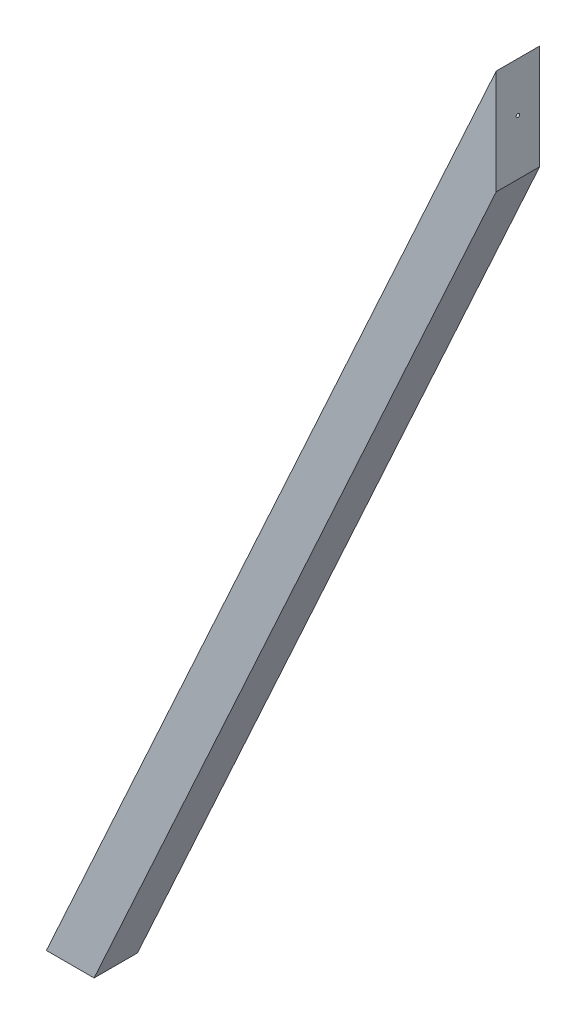
ISO-10303-21;
HEADER;
FILE_DESCRIPTION(('STEP AP214'),'2;1');
FILE_NAME('part.step','',(''),(''),'','','');
FILE_SCHEMA(('AUTOMOTIVE_DESIGN { 1 0 10303 214 1 1 1 1 }'));
ENDSEC;
DATA;
#1=APPLICATION_CONTEXT('core data for automotive mechanical design processes');
#2=APPLICATION_PROTOCOL_DEFINITION('international standard','automotive_design',2000,#1);
#3=PRODUCT_CONTEXT('',#1,'mechanical');
#4=PRODUCT('Part','Part','',(#3));
#5=PRODUCT_RELATED_PRODUCT_CATEGORY('part','',(#4));
#6=PRODUCT_DEFINITION_FORMATION('','',#4);
#7=PRODUCT_DEFINITION_CONTEXT('part definition',#1,'design');
#8=PRODUCT_DEFINITION('design','',#6,#7);
#9=PRODUCT_DEFINITION_SHAPE('','',#8);
#10=(LENGTH_UNIT() NAMED_UNIT(*) SI_UNIT(.MILLI.,.METRE.));
#11=(NAMED_UNIT(*) PLANE_ANGLE_UNIT() SI_UNIT($,.RADIAN.));
#12=(NAMED_UNIT(*) SI_UNIT($,.STERADIAN.) SOLID_ANGLE_UNIT());
#13=UNCERTAINTY_MEASURE_WITH_UNIT(LENGTH_MEASURE(1.E-05),#10,'distance_accuracy_value','');
#14=(GEOMETRIC_REPRESENTATION_CONTEXT(3) GLOBAL_UNCERTAINTY_ASSIGNED_CONTEXT((#13)) GLOBAL_UNIT_ASSIGNED_CONTEXT((#10,
#11,#12)) REPRESENTATION_CONTEXT('',''));
#15=CARTESIAN_POINT('',(0.,0.,0.));
#16=DIRECTION('',(0.,0.,1.));
#17=DIRECTION('',(1.,0.,0.));
#18=AXIS2_PLACEMENT_3D('',#15,#16,#17);
#19=CARTESIAN_POINT('',(-44.,893.950214076169,44.));
#20=DIRECTION('',(-1.,0.,0.));
#21=DIRECTION('',(0.,-1.,0.));
#22=AXIS2_PLACEMENT_3D('',#19,#20,#21);
#23=PLANE('',#22);
#24=CARTESIAN_POINT('',(-44.,950.,22.));
#25=DIRECTION('',(1.,0.,0.));
#26=DIRECTION('',(0.,1.,0.));
#27=AXIS2_PLACEMENT_3D('',#24,#25,#26);
#28=CIRCLE('',#27,1.74999999999994);
#29=CARTESIAN_POINT('',(-44.,951.75,22.));
#30=VERTEX_POINT('',#29);
#31=EDGE_CURVE('E120',#30,#30,#28,.T.);
#32=ORIENTED_EDGE('',*,*,#31,.F.);
#33=EDGE_LOOP('',(#32));
#34=FACE_BOUND('',#33,.T.);
#35=DIRECTION('',(0.,1.,0.));
#36=VECTOR('',#35,1.);
#37=CARTESIAN_POINT('',(-44.,893.950214076169,0.));
#38=LINE('',#37,#36);
#39=CARTESIAN_POINT('',(-44.,893.950214076169,0.));
#40=VERTEX_POINT('',#39);
#41=CARTESIAN_POINT('',(-44.,1000.,0.));
#42=VERTEX_POINT('',#41);
#43=EDGE_CURVE('E104',#40,#42,#38,.T.);
#44=ORIENTED_EDGE('',*,*,#43,.T.);
#45=DIRECTION('',(0.,0.,-1.));
#46=VECTOR('',#45,1.);
#47=CARTESIAN_POINT('',(-44.,1000.,44.));
#48=LINE('',#47,#46);
#49=CARTESIAN_POINT('',(-44.,1000.,44.));
#50=VERTEX_POINT('',#49);
#51=EDGE_CURVE('E11',#50,#42,#48,.T.);
#52=ORIENTED_EDGE('',*,*,#51,.F.);
#53=DIRECTION('',(0.,1.,0.));
#54=VECTOR('',#53,1.);
#55=CARTESIAN_POINT('',(-44.,893.950214076169,44.));
#56=LINE('',#55,#54);
#57=CARTESIAN_POINT('',(-44.,893.950214076169,44.));
#58=VERTEX_POINT('',#57);
#59=EDGE_CURVE('E92',#58,#50,#56,.T.);
#60=ORIENTED_EDGE('',*,*,#59,.F.);
#61=DIRECTION('',(0.,0.,-1.));
#62=VECTOR('',#61,1.);
#63=CARTESIAN_POINT('',(-44.,893.950214076169,44.));
#64=LINE('',#63,#62);
#65=EDGE_CURVE('E100',#58,#40,#64,.T.);
#66=ORIENTED_EDGE('',*,*,#65,.T.);
#67=EDGE_LOOP('',(#44,#52,#60,#66));
#68=FACE_BOUND('',#67,.T.);
#69=ADVANCED_FACE('F41',(#34,#68),#23,.F.);
#70=CARTESIAN_POINT('',(-44.,1000.,44.));
#71=DIRECTION('',(0.909867259321751,-0.414899470250717,0.));
#72=DIRECTION('',(0.414899470250717,0.909867259321751,0.));
#73=AXIS2_PLACEMENT_3D('',#70,#71,#72);
#74=PLANE('',#73);
#75=CARTESIAN_POINT('',(-66.7999999999999,950.,22.));
#76=DIRECTION('',(0.909867259321751,-0.414899470250717,0.));
#77=DIRECTION('',(0.414899470250717,0.909867259321751,0.));
#78=AXIS2_PLACEMENT_3D('',#75,#76,#77);
#79=ELLIPSE('',#78,1.92335748107307,1.74999999999994);
#80=CARTESIAN_POINT('',(-66.002,951.75,22.));
#81=VERTEX_POINT('',#80);
#82=EDGE_CURVE('E107',#81,#81,#79,.F.);
#83=ORIENTED_EDGE('',*,*,#82,.F.);
#84=EDGE_LOOP('',(#83));
#85=FACE_BOUND('',#84,.T.);
#86=DIRECTION('',(-0.414899470250717,-0.909867259321751,0.));
#87=VECTOR('',#86,1.);
#88=CARTESIAN_POINT('',(-44.,1000.,0.));
#89=LINE('',#88,#87);
#90=CARTESIAN_POINT('',(-499.999999999998,0.,0.));
#91=VERTEX_POINT('',#90);
#92=EDGE_CURVE('E96',#42,#91,#89,.T.);
#93=ORIENTED_EDGE('',*,*,#92,.T.);
#94=DIRECTION('',(0.,0.,-1.));
#95=VECTOR('',#94,1.);
#96=CARTESIAN_POINT('',(-499.999999999998,0.,44.));
#97=LINE('',#96,#95);
#98=CARTESIAN_POINT('',(-499.999999999998,0.,44.));
#99=VERTEX_POINT('',#98);
#100=EDGE_CURVE('E49',#99,#91,#97,.T.);
#101=ORIENTED_EDGE('',*,*,#100,.F.);
#102=DIRECTION('',(-0.414899470250717,-0.909867259321751,0.));
#103=VECTOR('',#102,1.);
#104=CARTESIAN_POINT('',(-44.,1000.,44.));
#105=LINE('',#104,#103);
#106=EDGE_CURVE('E87',#50,#99,#105,.T.);
#107=ORIENTED_EDGE('',*,*,#106,.F.);
#108=ORIENTED_EDGE('',*,*,#51,.T.);
#109=EDGE_LOOP('',(#93,#101,#107,#108));
#110=FACE_BOUND('',#109,.T.);
#111=ADVANCED_FACE('F95',(#85,#110),#74,.F.);
#112=CARTESIAN_POINT('',(-499.999999999998,0.,44.));
#113=DIRECTION('',(0.,1.,0.));
#114=DIRECTION('',(-1.,0.,0.));
#115=AXIS2_PLACEMENT_3D('',#112,#113,#114);
#116=PLANE('',#115);
#117=DIRECTION('',(1.,0.,0.));
#118=VECTOR('',#117,1.);
#119=CARTESIAN_POINT('',(-499.999999999998,0.,0.));
#120=LINE('',#119,#118);
#121=CARTESIAN_POINT('',(-451.641297618731,0.,0.));
#122=VERTEX_POINT('',#121);
#123=EDGE_CURVE('E74',#91,#122,#120,.T.);
#124=ORIENTED_EDGE('',*,*,#123,.T.);
#125=DIRECTION('',(0.,0.,-1.));
#126=VECTOR('',#125,1.);
#127=CARTESIAN_POINT('',(-451.641297618731,0.,44.));
#128=LINE('',#127,#126);
#129=CARTESIAN_POINT('',(-451.641297618731,0.,44.));
#130=VERTEX_POINT('',#129);
#131=EDGE_CURVE('E97',#130,#122,#128,.T.);
#132=ORIENTED_EDGE('',*,*,#131,.F.);
#133=DIRECTION('',(1.,0.,0.));
#134=VECTOR('',#133,1.);
#135=CARTESIAN_POINT('',(-499.999999999998,0.,44.));
#136=LINE('',#135,#134);
#137=EDGE_CURVE('E90',#99,#130,#136,.T.);
#138=ORIENTED_EDGE('',*,*,#137,.F.);
#139=ORIENTED_EDGE('',*,*,#100,.T.);
#140=EDGE_LOOP('',(#124,#132,#138,#139));
#141=FACE_BOUND('',#140,.T.);
#142=ADVANCED_FACE('F98',(#141),#116,.F.);
#143=CARTESIAN_POINT('',(-451.641297618731,0.,44.));
#144=DIRECTION('',(-0.909867259321751,0.414899470250717,0.));
#145=DIRECTION('',(-0.414899470250717,-0.909867259321751,0.));
#146=AXIS2_PLACEMENT_3D('',#143,#144,#145);
#147=PLANE('',#146);
#148=DIRECTION('',(0.414899470250716,0.909867259321751,0.));
#149=VECTOR('',#148,1.);
#150=CARTESIAN_POINT('',(-451.641297618731,0.,0.));
#151=LINE('',#150,#149);
#152=EDGE_CURVE('E80',#122,#40,#151,.T.);
#153=ORIENTED_EDGE('',*,*,#152,.T.);
#154=ORIENTED_EDGE('',*,*,#65,.F.);
#155=DIRECTION('',(0.414899470250716,0.909867259321751,0.));
#156=VECTOR('',#155,1.);
#157=CARTESIAN_POINT('',(-451.641297618731,0.,44.));
#158=LINE('',#157,#156);
#159=EDGE_CURVE('E57',#130,#58,#158,.T.);
#160=ORIENTED_EDGE('',*,*,#159,.F.);
#161=ORIENTED_EDGE('',*,*,#131,.T.);
#162=EDGE_LOOP('',(#153,#154,#160,#161));
#163=FACE_BOUND('',#162,.T.);
#164=ADVANCED_FACE('F112',(#163),#147,.F.);
#165=CARTESIAN_POINT('',(0.,0.,44.));
#166=DIRECTION('',(0.,0.,-1.));
#167=DIRECTION('',(-1.,0.,0.));
#168=AXIS2_PLACEMENT_3D('',#165,#166,#167);
#169=PLANE('',#168);
#170=ORIENTED_EDGE('',*,*,#59,.T.);
#171=ORIENTED_EDGE('',*,*,#106,.T.);
#172=ORIENTED_EDGE('',*,*,#137,.T.);
#173=ORIENTED_EDGE('',*,*,#159,.T.);
#174=EDGE_LOOP('',(#170,#171,#172,#173));
#175=FACE_BOUND('',#174,.T.);
#176=ADVANCED_FACE('F88',(#175),#169,.F.);
#177=CARTESIAN_POINT('',(0.,0.,0.));
#178=DIRECTION('',(0.,0.,-1.));
#179=DIRECTION('',(-1.,0.,0.));
#180=AXIS2_PLACEMENT_3D('',#177,#178,#179);
#181=PLANE('',#180);
#182=ORIENTED_EDGE('',*,*,#43,.F.);
#183=ORIENTED_EDGE('',*,*,#152,.F.);
#184=ORIENTED_EDGE('',*,*,#123,.F.);
#185=ORIENTED_EDGE('',*,*,#92,.F.);
#186=EDGE_LOOP('',(#182,#183,#184,#185));
#187=FACE_BOUND('',#186,.T.);
#188=ADVANCED_FACE('F115',(#187),#181,.T.);
#189=CARTESIAN_POINT('',(-71.994911969178,950.,22.));
#190=DIRECTION('',(1.,0.,0.));
#191=DIRECTION('',(0.,1.,0.));
#192=AXIS2_PLACEMENT_3D('',#189,#190,#191);
#193=CYLINDRICAL_SURFACE('',#192,1.74999999999994);
#194=ORIENTED_EDGE('',*,*,#82,.T.);
#195=EDGE_LOOP('',(#194));
#196=FACE_BOUND('',#195,.T.);
#197=ORIENTED_EDGE('',*,*,#31,.T.);
#198=EDGE_LOOP('',(#197));
#199=FACE_BOUND('',#198,.T.);
#200=ADVANCED_FACE('F124',(#196,#199),#193,.F.);
#201=CLOSED_SHELL('',(#69,#111,#142,#164,#176,#188,#200));
#202=MANIFOLD_SOLID_BREP('B2',#201);
#203=ADVANCED_BREP_SHAPE_REPRESENTATION('',(#18,#202),#14);
#204=SHAPE_DEFINITION_REPRESENTATION(#9,#203);
ENDSEC;
END-ISO-10303-21;
